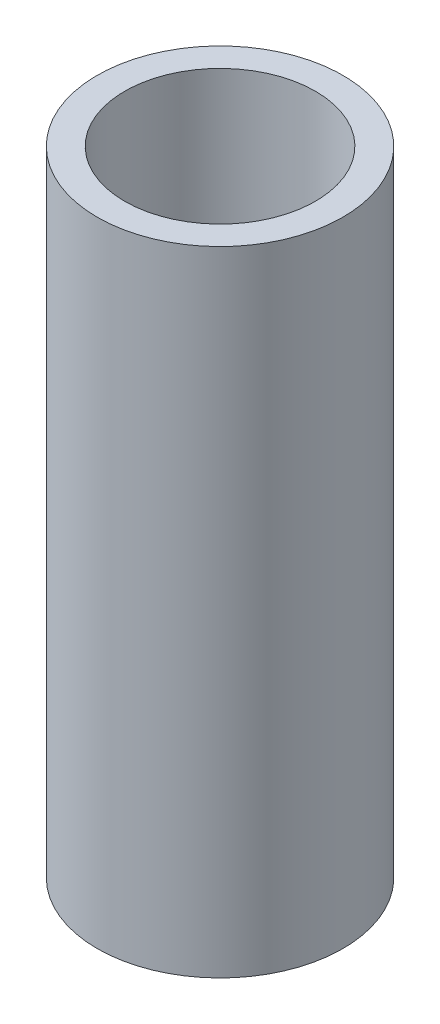
ISO-10303-21;
HEADER;
FILE_DESCRIPTION(('STEP AP214'),'2;1');
FILE_NAME('part.step','',(''),(''),'','','');
FILE_SCHEMA(('AUTOMOTIVE_DESIGN { 1 0 10303 214 1 1 1 1 }'));
ENDSEC;
DATA;
#1=APPLICATION_CONTEXT('core data for automotive mechanical design processes');
#2=APPLICATION_PROTOCOL_DEFINITION('international standard','automotive_design',2000,#1);
#3=PRODUCT_CONTEXT('',#1,'mechanical');
#4=PRODUCT('Part','Part','',(#3));
#5=PRODUCT_RELATED_PRODUCT_CATEGORY('part','',(#4));
#6=PRODUCT_DEFINITION_FORMATION('','',#4);
#7=PRODUCT_DEFINITION_CONTEXT('part definition',#1,'design');
#8=PRODUCT_DEFINITION('design','',#6,#7);
#9=PRODUCT_DEFINITION_SHAPE('','',#8);
#10=(LENGTH_UNIT() NAMED_UNIT(*) SI_UNIT(.MILLI.,.METRE.));
#11=(NAMED_UNIT(*) PLANE_ANGLE_UNIT() SI_UNIT($,.RADIAN.));
#12=(NAMED_UNIT(*) SI_UNIT($,.STERADIAN.) SOLID_ANGLE_UNIT());
#13=UNCERTAINTY_MEASURE_WITH_UNIT(LENGTH_MEASURE(1.E-05),#10,'distance_accuracy_value','');
#14=(GEOMETRIC_REPRESENTATION_CONTEXT(3) GLOBAL_UNCERTAINTY_ASSIGNED_CONTEXT((#13)) GLOBAL_UNIT_ASSIGNED_CONTEXT((#10,
#11,#12)) REPRESENTATION_CONTEXT('',''));
#15=CARTESIAN_POINT('',(0.,0.,0.));
#16=DIRECTION('',(0.,0.,1.));
#17=DIRECTION('',(1.,0.,0.));
#18=AXIS2_PLACEMENT_3D('',#15,#16,#17);
#19=CARTESIAN_POINT('',(0.,77.3329356612912,0.));
#20=DIRECTION('',(0.,-1.,0.));
#21=DIRECTION('',(0.,0.,-1.));
#22=AXIS2_PLACEMENT_3D('',#19,#20,#21);
#23=CYLINDRICAL_SURFACE('',#22,15.);
#24=CARTESIAN_POINT('',(0.,77.3329356612912,0.));
#25=DIRECTION('',(0.,1.,0.));
#26=DIRECTION('',(0.,0.,1.));
#27=AXIS2_PLACEMENT_3D('',#24,#25,#26);
#28=CIRCLE('',#27,15.);
#29=CARTESIAN_POINT('',(0.,77.3329356612912,15.));
#30=VERTEX_POINT('',#29);
#31=EDGE_CURVE('E10',#30,#30,#28,.T.);
#32=ORIENTED_EDGE('',*,*,#31,.F.);
#33=EDGE_LOOP('',(#32));
#34=FACE_BOUND('',#33,.T.);
#35=CARTESIAN_POINT('',(0.,0.,0.));
#36=DIRECTION('',(0.,1.,0.));
#37=DIRECTION('',(0.,0.,1.));
#38=AXIS2_PLACEMENT_3D('',#35,#36,#37);
#39=CIRCLE('',#38,15.);
#40=CARTESIAN_POINT('',(0.,0.,15.));
#41=VERTEX_POINT('',#40);
#42=EDGE_CURVE('E37',#41,#41,#39,.T.);
#43=ORIENTED_EDGE('',*,*,#42,.T.);
#44=EDGE_LOOP('',(#43));
#45=FACE_BOUND('',#44,.T.);
#46=ADVANCED_FACE('F40',(#34,#45),#23,.T.);
#47=CARTESIAN_POINT('',(0.,77.3329356612912,0.));
#48=DIRECTION('',(0.,1.,0.));
#49=DIRECTION('',(0.,0.,1.));
#50=AXIS2_PLACEMENT_3D('',#47,#48,#49);
#51=PLANE('',#50);
#52=CARTESIAN_POINT('',(0.,77.3329356612912,0.));
#53=DIRECTION('',(0.,1.,0.));
#54=DIRECTION('',(0.,0.,1.));
#55=AXIS2_PLACEMENT_3D('',#52,#53,#54);
#56=CIRCLE('',#55,11.6431033871644);
#57=CARTESIAN_POINT('',(0.,77.3329356612912,11.6431033871644));
#58=VERTEX_POINT('',#57);
#59=EDGE_CURVE('E50',#58,#58,#56,.T.);
#60=ORIENTED_EDGE('',*,*,#59,.F.);
#61=EDGE_LOOP('',(#60));
#62=FACE_BOUND('',#61,.T.);
#63=ORIENTED_EDGE('',*,*,#31,.T.);
#64=EDGE_LOOP('',(#63));
#65=FACE_BOUND('',#64,.T.);
#66=ADVANCED_FACE('F59',(#62,#65),#51,.T.);
#67=CARTESIAN_POINT('',(0.,0.,0.));
#68=DIRECTION('',(0.,1.,0.));
#69=DIRECTION('',(0.,0.,1.));
#70=AXIS2_PLACEMENT_3D('',#67,#68,#69);
#71=PLANE('',#70);
#72=CARTESIAN_POINT('',(0.,0.,0.));
#73=DIRECTION('',(0.,1.,0.));
#74=DIRECTION('',(0.,0.,1.));
#75=AXIS2_PLACEMENT_3D('',#72,#73,#74);
#76=CIRCLE('',#75,11.6431033871644);
#77=CARTESIAN_POINT('',(0.,0.,11.6431033871644));
#78=VERTEX_POINT('',#77);
#79=EDGE_CURVE('E47',#78,#78,#76,.T.);
#80=ORIENTED_EDGE('',*,*,#79,.T.);
#81=EDGE_LOOP('',(#80));
#82=FACE_BOUND('',#81,.T.);
#83=ORIENTED_EDGE('',*,*,#42,.F.);
#84=EDGE_LOOP('',(#83));
#85=FACE_BOUND('',#84,.T.);
#86=ADVANCED_FACE('F58',(#82,#85),#71,.F.);
#87=CARTESIAN_POINT('',(0.,77.3329356612912,0.));
#88=DIRECTION('',(0.,-1.,0.));
#89=DIRECTION('',(0.,0.,-1.));
#90=AXIS2_PLACEMENT_3D('',#87,#88,#89);
#91=CYLINDRICAL_SURFACE('',#90,11.6431033871644);
#92=ORIENTED_EDGE('',*,*,#59,.T.);
#93=EDGE_LOOP('',(#92));
#94=FACE_BOUND('',#93,.T.);
#95=ORIENTED_EDGE('',*,*,#79,.F.);
#96=EDGE_LOOP('',(#95));
#97=FACE_BOUND('',#96,.T.);
#98=ADVANCED_FACE('F54',(#94,#97),#91,.F.);
#99=CLOSED_SHELL('',(#46,#66,#86,#98));
#100=MANIFOLD_SOLID_BREP('B2',#99);
#101=ADVANCED_BREP_SHAPE_REPRESENTATION('',(#18,#100),#14);
#102=SHAPE_DEFINITION_REPRESENTATION(#9,#101);
ENDSEC;
END-ISO-10303-21;
